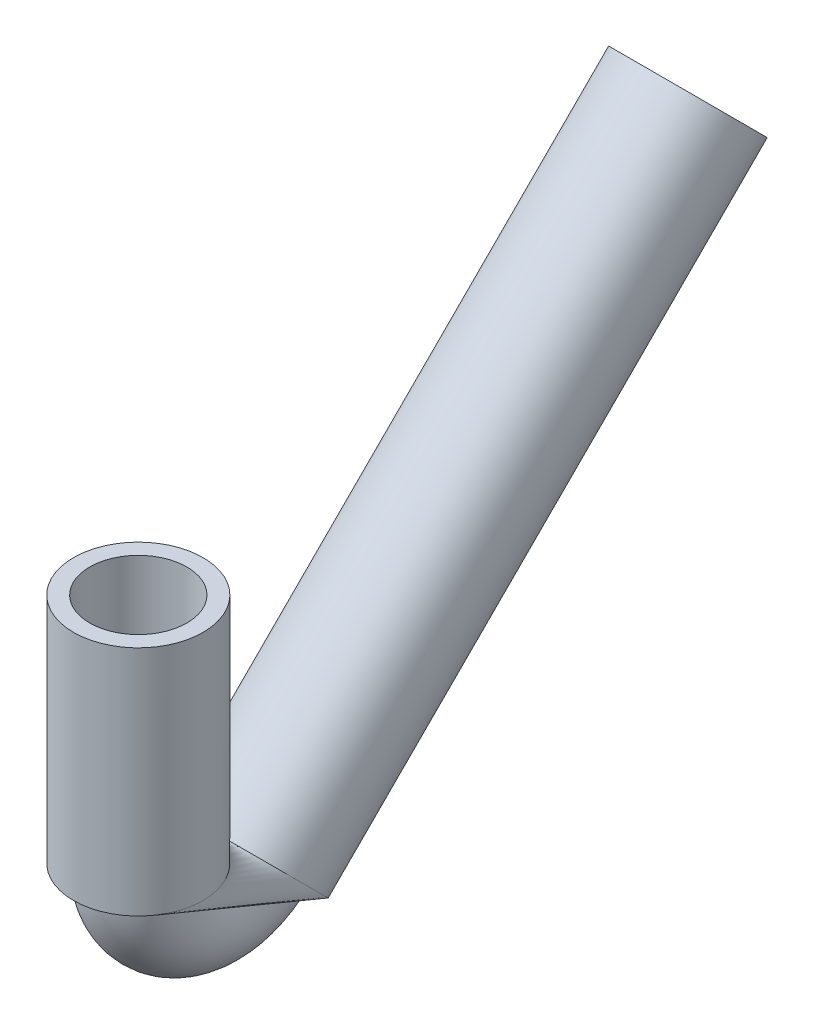
ISO-10303-21;
HEADER;
FILE_DESCRIPTION(('STEP AP214'),'2;1');
FILE_NAME('part.step','',(''),(''),'','','');
FILE_SCHEMA(('AUTOMOTIVE_DESIGN { 1 0 10303 214 1 1 1 1 }'));
ENDSEC;
DATA;
#1=APPLICATION_CONTEXT('core data for automotive mechanical design processes');
#2=APPLICATION_PROTOCOL_DEFINITION('international standard','automotive_design',2000,#1);
#3=PRODUCT_CONTEXT('',#1,'mechanical');
#4=PRODUCT('Part','Part','',(#3));
#5=PRODUCT_RELATED_PRODUCT_CATEGORY('part','',(#4));
#6=PRODUCT_DEFINITION_FORMATION('','',#4);
#7=PRODUCT_DEFINITION_CONTEXT('part definition',#1,'design');
#8=PRODUCT_DEFINITION('design','',#6,#7);
#9=PRODUCT_DEFINITION_SHAPE('','',#8);
#10=(LENGTH_UNIT() NAMED_UNIT(*) SI_UNIT(.MILLI.,.METRE.));
#11=(NAMED_UNIT(*) PLANE_ANGLE_UNIT() SI_UNIT($,.RADIAN.));
#12=(NAMED_UNIT(*) SI_UNIT($,.STERADIAN.) SOLID_ANGLE_UNIT());
#13=UNCERTAINTY_MEASURE_WITH_UNIT(LENGTH_MEASURE(1.E-05),#10,'distance_accuracy_value','');
#14=(GEOMETRIC_REPRESENTATION_CONTEXT(3) GLOBAL_UNCERTAINTY_ASSIGNED_CONTEXT((#13)) GLOBAL_UNIT_ASSIGNED_CONTEXT((#10,
#11,#12)) REPRESENTATION_CONTEXT('',''));
#15=CARTESIAN_POINT('',(0.,0.,0.));
#16=DIRECTION('',(0.,0.,1.));
#17=DIRECTION('',(1.,0.,0.));
#18=AXIS2_PLACEMENT_3D('',#15,#16,#17);
#19=CARTESIAN_POINT('',(0.,-54.5197438789306,-21.6802561210692));
#20=DIRECTION('',(0.,0.707106781186551,-0.707106781186544));
#21=DIRECTION('',(0.,0.707106781186544,0.707106781186551));
#22=AXIS2_PLACEMENT_3D('',#19,#20,#21);
#23=CYLINDRICAL_SURFACE('',#22,12.7);
#24=CARTESIAN_POINT('',(0.,-54.5197438789306,-21.6802561210692));
#25=DIRECTION('',(0.,-0.707106781186551,0.707106781186544));
#26=DIRECTION('',(0.,-0.707106781186544,-0.707106781186551));
#27=AXIS2_PLACEMENT_3D('',#24,#25,#26);
#28=CIRCLE('',#27,12.7);
#29=CARTESIAN_POINT('',(0.,-45.5394877578615,-12.7));
#30=VERTEX_POINT('',#29);
#31=EDGE_CURVE('E50',#30,#30,#28,.T.);
#32=ORIENTED_EDGE('',*,*,#31,.F.);
#33=DIRECTION('',(0.,0.707106781186551,-0.707106781186544));
#34=VECTOR('',#33,1.);
#35=CARTESIAN_POINT('',(0.,-45.5394877578615,-12.7));
#36=LINE('',#35,#34);
#37=CARTESIAN_POINT('',(0.,40.5433295738995,-98.78281733176));
#38=VERTEX_POINT('',#37);
#39=EDGE_CURVE('E11',#30,#38,#36,.T.);
#40=ORIENTED_EDGE('',*,*,#39,.T.);
#41=CARTESIAN_POINT('',(0.,31.5630734528304,-107.763073452829));
#42=DIRECTION('',(0.,-0.707106781186551,0.707106781186544));
#43=DIRECTION('',(0.,-0.707106781186544,-0.707106781186551));
#44=AXIS2_PLACEMENT_3D('',#41,#42,#43);
#45=CIRCLE('',#44,12.7);
#46=EDGE_CURVE('E42',#38,#38,#45,.T.);
#47=ORIENTED_EDGE('',*,*,#46,.T.);
#48=ORIENTED_EDGE('',*,*,#39,.F.);
#49=EDGE_LOOP('',(#32,#40,#47,#48));
#50=FACE_BOUND('',#49,.T.);
#51=ADVANCED_FACE('F35',(#50),#23,.T.);
#52=CARTESIAN_POINT('',(0.,-54.5197438789306,-21.6802561210692));
#53=DIRECTION('',(0.,0.707106781186551,-0.707106781186544));
#54=DIRECTION('',(0.,0.707106781186544,0.707106781186551));
#55=AXIS2_PLACEMENT_3D('',#52,#53,#54);
#56=CYLINDRICAL_SURFACE('',#55,9.525);
#57=CARTESIAN_POINT('',(0.,-54.5197438789306,-21.6802561210692));
#58=DIRECTION('',(0.,-0.707106781186551,0.707106781186544));
#59=DIRECTION('',(0.,-0.707106781186544,-0.707106781186551));
#60=AXIS2_PLACEMENT_3D('',#57,#58,#59);
#61=CIRCLE('',#60,9.525);
#62=CARTESIAN_POINT('',(0.,-61.2549359697324,-28.4154482118711));
#63=VERTEX_POINT('',#62);
#64=EDGE_CURVE('E55',#63,#63,#61,.T.);
#65=ORIENTED_EDGE('',*,*,#64,.T.);
#66=EDGE_LOOP('',(#65));
#67=FACE_BOUND('',#66,.T.);
#68=CARTESIAN_POINT('',(0.,31.5630734528304,-107.763073452829));
#69=DIRECTION('',(0.,-0.707106781186551,0.707106781186544));
#70=DIRECTION('',(0.,-0.707106781186544,-0.707106781186551));
#71=AXIS2_PLACEMENT_3D('',#68,#69,#70);
#72=CIRCLE('',#71,9.525);
#73=CARTESIAN_POINT('',(0.,24.8278813620286,-114.498265543631));
#74=VERTEX_POINT('',#73);
#75=EDGE_CURVE('E54',#74,#74,#72,.T.);
#76=ORIENTED_EDGE('',*,*,#75,.F.);
#77=EDGE_LOOP('',(#76));
#78=FACE_BOUND('',#77,.T.);
#79=ADVANCED_FACE('F79',(#67,#78),#56,.F.);
#80=CARTESIAN_POINT('',(0.,-45.5394877578615,-12.7));
#81=DIRECTION('',(1.,0.,0.));
#82=DIRECTION('',(0.,0.,-1.));
#83=AXIS2_PLACEMENT_3D('',#80,#81,#82);
#84=DEGENERATE_TOROIDAL_SURFACE('',#83,12.7,12.7,.T.);
#85=CARTESIAN_POINT('',(0.,-45.5394877578615,0.));
#86=DIRECTION('',(0.,1.,0.));
#87=DIRECTION('',(0.,0.,1.));
#88=AXIS2_PLACEMENT_3D('',#85,#86,#87);
#89=CIRCLE('',#88,12.7);
#90=EDGE_CURVE('E57',#30,#30,#89,.T.);
#91=ORIENTED_EDGE('',*,*,#90,.F.);
#92=ORIENTED_EDGE('',*,*,#31,.T.);
#93=EDGE_LOOP('',(#91,#92));
#94=FACE_BOUND('',#93,.T.);
#95=ADVANCED_FACE('F58',(#94),#84,.T.);
#96=CARTESIAN_POINT('',(0.,-45.5394877578615,-12.7));
#97=DIRECTION('',(1.,0.,0.));
#98=DIRECTION('',(0.,0.,-1.));
#99=AXIS2_PLACEMENT_3D('',#96,#97,#98);
#100=TOROIDAL_SURFACE('',#99,12.7,9.525);
#101=CARTESIAN_POINT('',(0.,-45.5394877578615,0.));
#102=DIRECTION('',(0.,1.,0.));
#103=DIRECTION('',(0.,0.,1.));
#104=AXIS2_PLACEMENT_3D('',#101,#102,#103);
#105=CIRCLE('',#104,9.525);
#106=CARTESIAN_POINT('',(0.,-45.5394877578615,9.525));
#107=VERTEX_POINT('',#106);
#108=EDGE_CURVE('E60',#107,#107,#105,.T.);
#109=CARTESIAN_POINT('',(0.,-45.5394877578615,-12.7));
#110=DIRECTION('',(1.,0.,0.));
#111=DIRECTION('',(0.,0.,-1.));
#112=AXIS2_PLACEMENT_3D('',#109,#110,#111);
#113=CIRCLE('',#112,22.225);
#114=EDGE_CURVE('',#107,#63,#113,.T.);
#115=ORIENTED_EDGE('',*,*,#108,.T.);
#116=ORIENTED_EDGE('',*,*,#64,.F.);
#117=ORIENTED_EDGE('',*,*,#114,.T.);
#118=ORIENTED_EDGE('',*,*,#114,.F.);
#119=EDGE_LOOP('',(#115,#117,#116,#118));
#120=FACE_BOUND('',#119,.T.);
#121=ADVANCED_FACE('F86',(#120),#100,.F.);
#122=CARTESIAN_POINT('',(0.,-45.5394877578615,0.));
#123=DIRECTION('',(0.,1.,0.));
#124=DIRECTION('',(0.,0.,1.));
#125=AXIS2_PLACEMENT_3D('',#122,#123,#124);
#126=CYLINDRICAL_SURFACE('',#125,9.525);
#127=ORIENTED_EDGE('',*,*,#108,.F.);
#128=EDGE_LOOP('',(#127));
#129=FACE_BOUND('',#128,.T.);
#130=CARTESIAN_POINT('',(0.,0.,0.));
#131=DIRECTION('',(0.,1.,0.));
#132=DIRECTION('',(0.,0.,1.));
#133=AXIS2_PLACEMENT_3D('',#130,#131,#132);
#134=CIRCLE('',#133,9.525);
#135=CARTESIAN_POINT('',(0.,0.,9.525));
#136=VERTEX_POINT('',#135);
#137=EDGE_CURVE('E68',#136,#136,#134,.T.);
#138=ORIENTED_EDGE('',*,*,#137,.T.);
#139=EDGE_LOOP('',(#138));
#140=FACE_BOUND('',#139,.T.);
#141=ADVANCED_FACE('F91',(#129,#140),#126,.F.);
#142=CARTESIAN_POINT('',(0.,-45.5394877578615,0.));
#143=DIRECTION('',(0.,1.,0.));
#144=DIRECTION('',(0.,0.,1.));
#145=AXIS2_PLACEMENT_3D('',#142,#143,#144);
#146=CYLINDRICAL_SURFACE('',#145,12.7);
#147=ORIENTED_EDGE('',*,*,#90,.T.);
#148=EDGE_LOOP('',(#147));
#149=FACE_BOUND('',#148,.T.);
#150=CARTESIAN_POINT('',(0.,0.,0.));
#151=DIRECTION('',(0.,1.,0.));
#152=DIRECTION('',(0.,0.,1.));
#153=AXIS2_PLACEMENT_3D('',#150,#151,#152);
#154=CIRCLE('',#153,12.7);
#155=CARTESIAN_POINT('',(0.,0.,12.7));
#156=VERTEX_POINT('',#155);
#157=EDGE_CURVE('E65',#156,#156,#154,.T.);
#158=ORIENTED_EDGE('',*,*,#157,.F.);
#159=EDGE_LOOP('',(#158));
#160=FACE_BOUND('',#159,.T.);
#161=ADVANCED_FACE('F95',(#149,#160),#146,.T.);
#162=CARTESIAN_POINT('',(0.,31.5630734528304,-107.763073452829));
#163=DIRECTION('',(0.,-0.707106781186551,0.707106781186544));
#164=DIRECTION('',(0.,-0.707106781186544,-0.707106781186551));
#165=AXIS2_PLACEMENT_3D('',#162,#163,#164);
#166=PLANE('',#165);
#167=ORIENTED_EDGE('',*,*,#75,.T.);
#168=EDGE_LOOP('',(#167));
#169=FACE_BOUND('',#168,.T.);
#170=ORIENTED_EDGE('',*,*,#46,.F.);
#171=EDGE_LOOP('',(#170));
#172=FACE_BOUND('',#171,.T.);
#173=ADVANCED_FACE('F76',(#169,#172),#166,.F.);
#174=CARTESIAN_POINT('',(0.,0.,0.));
#175=DIRECTION('',(0.,1.,0.));
#176=DIRECTION('',(0.,0.,1.));
#177=AXIS2_PLACEMENT_3D('',#174,#175,#176);
#178=PLANE('',#177);
#179=ORIENTED_EDGE('',*,*,#137,.F.);
#180=EDGE_LOOP('',(#179));
#181=FACE_BOUND('',#180,.T.);
#182=ORIENTED_EDGE('',*,*,#157,.T.);
#183=EDGE_LOOP('',(#182));
#184=FACE_BOUND('',#183,.T.);
#185=ADVANCED_FACE('F99',(#181,#184),#178,.T.);
#186=CLOSED_SHELL('',(#51,#79,#95,#121,#141,#161,#173,#185));
#187=MANIFOLD_SOLID_BREP('B2',#186);
#188=ADVANCED_BREP_SHAPE_REPRESENTATION('',(#18,#187),#14);
#189=SHAPE_DEFINITION_REPRESENTATION(#9,#188);
ENDSEC;
END-ISO-10303-21;
